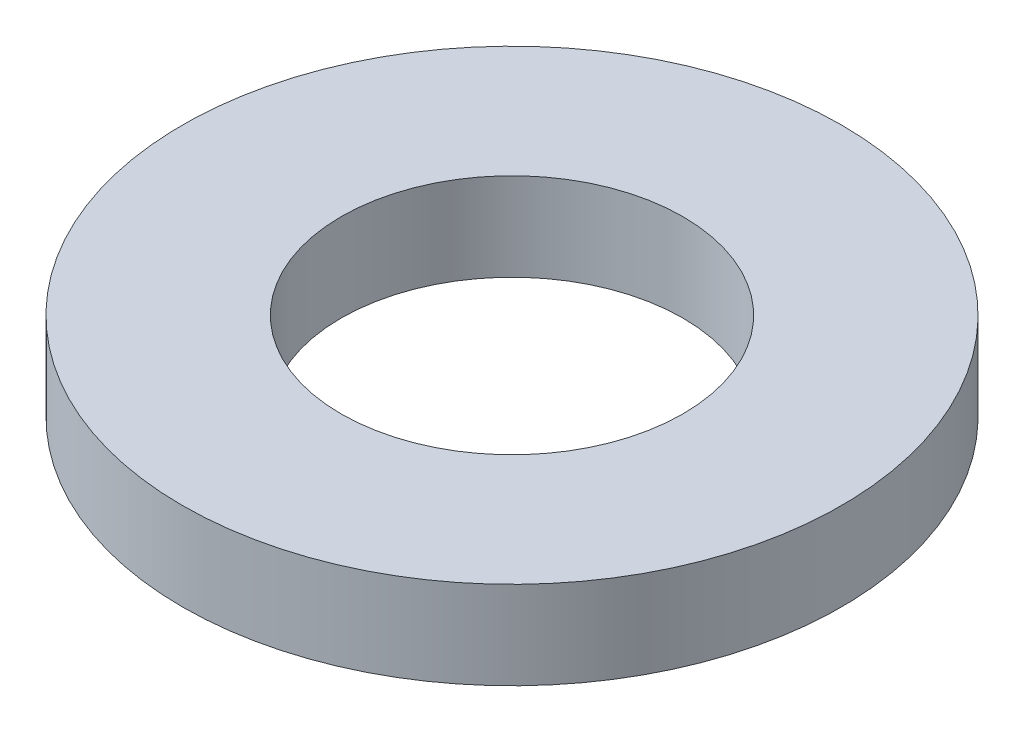
ISO-10303-21;
HEADER;
FILE_DESCRIPTION(('STEP AP214'),'2;1');
FILE_NAME('part.step','',(''),(''),'','','');
FILE_SCHEMA(('AUTOMOTIVE_DESIGN { 1 0 10303 214 1 1 1 1 }'));
ENDSEC;
DATA;
#1=APPLICATION_CONTEXT('core data for automotive mechanical design processes');
#2=APPLICATION_PROTOCOL_DEFINITION('international standard','automotive_design',2000,#1);
#3=PRODUCT_CONTEXT('',#1,'mechanical');
#4=PRODUCT('Part','Part','',(#3));
#5=PRODUCT_RELATED_PRODUCT_CATEGORY('part','',(#4));
#6=PRODUCT_DEFINITION_FORMATION('','',#4);
#7=PRODUCT_DEFINITION_CONTEXT('part definition',#1,'design');
#8=PRODUCT_DEFINITION('design','',#6,#7);
#9=PRODUCT_DEFINITION_SHAPE('','',#8);
#10=(LENGTH_UNIT() NAMED_UNIT(*) SI_UNIT(.MILLI.,.METRE.));
#11=(NAMED_UNIT(*) PLANE_ANGLE_UNIT() SI_UNIT($,.RADIAN.));
#12=(NAMED_UNIT(*) SI_UNIT($,.STERADIAN.) SOLID_ANGLE_UNIT());
#13=UNCERTAINTY_MEASURE_WITH_UNIT(LENGTH_MEASURE(1.E-05),#10,'distance_accuracy_value','');
#14=(GEOMETRIC_REPRESENTATION_CONTEXT(3) GLOBAL_UNCERTAINTY_ASSIGNED_CONTEXT((#13)) GLOBAL_UNIT_ASSIGNED_CONTEXT((#10,
#11,#12)) REPRESENTATION_CONTEXT('',''));
#15=CARTESIAN_POINT('',(0.,0.,0.));
#16=DIRECTION('',(0.,0.,1.));
#17=DIRECTION('',(1.,0.,0.));
#18=AXIS2_PLACEMENT_3D('',#15,#16,#17);
#19=CARTESIAN_POINT('',(0.,18.,0.));
#20=DIRECTION('',(0.,-1.,0.));
#21=DIRECTION('',(0.,0.,-1.));
#22=AXIS2_PLACEMENT_3D('',#19,#20,#21);
#23=CYLINDRICAL_SURFACE('',#22,67.5);
#24=CARTESIAN_POINT('',(0.,18.,0.));
#25=DIRECTION('',(0.,1.,0.));
#26=DIRECTION('',(0.,0.,1.));
#27=AXIS2_PLACEMENT_3D('',#24,#25,#26);
#28=CIRCLE('',#27,67.5);
#29=CARTESIAN_POINT('',(0.,18.,67.5));
#30=VERTEX_POINT('',#29);
#31=EDGE_CURVE('E10',#30,#30,#28,.T.);
#32=ORIENTED_EDGE('',*,*,#31,.F.);
#33=EDGE_LOOP('',(#32));
#34=FACE_BOUND('',#33,.T.);
#35=CARTESIAN_POINT('',(0.,0.,0.));
#36=DIRECTION('',(0.,1.,0.));
#37=DIRECTION('',(0.,0.,1.));
#38=AXIS2_PLACEMENT_3D('',#35,#36,#37);
#39=CIRCLE('',#38,67.5);
#40=CARTESIAN_POINT('',(0.,0.,67.5));
#41=VERTEX_POINT('',#40);
#42=EDGE_CURVE('E37',#41,#41,#39,.T.);
#43=ORIENTED_EDGE('',*,*,#42,.T.);
#44=EDGE_LOOP('',(#43));
#45=FACE_BOUND('',#44,.T.);
#46=ADVANCED_FACE('F40',(#34,#45),#23,.T.);
#47=CARTESIAN_POINT('',(0.,18.,0.));
#48=DIRECTION('',(0.,1.,0.));
#49=DIRECTION('',(0.,0.,1.));
#50=AXIS2_PLACEMENT_3D('',#47,#48,#49);
#51=PLANE('',#50);
#52=CARTESIAN_POINT('',(0.,18.,0.));
#53=DIRECTION('',(0.,1.,0.));
#54=DIRECTION('',(0.,0.,1.));
#55=AXIS2_PLACEMENT_3D('',#52,#53,#54);
#56=CIRCLE('',#55,35.);
#57=CARTESIAN_POINT('',(0.,18.,35.));
#58=VERTEX_POINT('',#57);
#59=EDGE_CURVE('E50',#58,#58,#56,.T.);
#60=ORIENTED_EDGE('',*,*,#59,.F.);
#61=EDGE_LOOP('',(#60));
#62=FACE_BOUND('',#61,.T.);
#63=ORIENTED_EDGE('',*,*,#31,.T.);
#64=EDGE_LOOP('',(#63));
#65=FACE_BOUND('',#64,.T.);
#66=ADVANCED_FACE('F59',(#62,#65),#51,.T.);
#67=CARTESIAN_POINT('',(0.,0.,0.));
#68=DIRECTION('',(0.,1.,0.));
#69=DIRECTION('',(0.,0.,1.));
#70=AXIS2_PLACEMENT_3D('',#67,#68,#69);
#71=PLANE('',#70);
#72=CARTESIAN_POINT('',(0.,0.,0.));
#73=DIRECTION('',(0.,1.,0.));
#74=DIRECTION('',(0.,0.,1.));
#75=AXIS2_PLACEMENT_3D('',#72,#73,#74);
#76=CIRCLE('',#75,35.);
#77=CARTESIAN_POINT('',(0.,0.,35.));
#78=VERTEX_POINT('',#77);
#79=EDGE_CURVE('E47',#78,#78,#76,.T.);
#80=ORIENTED_EDGE('',*,*,#79,.T.);
#81=EDGE_LOOP('',(#80));
#82=FACE_BOUND('',#81,.T.);
#83=ORIENTED_EDGE('',*,*,#42,.F.);
#84=EDGE_LOOP('',(#83));
#85=FACE_BOUND('',#84,.T.);
#86=ADVANCED_FACE('F58',(#82,#85),#71,.F.);
#87=CARTESIAN_POINT('',(0.,18.,0.));
#88=DIRECTION('',(0.,-1.,0.));
#89=DIRECTION('',(0.,0.,-1.));
#90=AXIS2_PLACEMENT_3D('',#87,#88,#89);
#91=CYLINDRICAL_SURFACE('',#90,35.);
#92=ORIENTED_EDGE('',*,*,#59,.T.);
#93=EDGE_LOOP('',(#92));
#94=FACE_BOUND('',#93,.T.);
#95=ORIENTED_EDGE('',*,*,#79,.F.);
#96=EDGE_LOOP('',(#95));
#97=FACE_BOUND('',#96,.T.);
#98=ADVANCED_FACE('F54',(#94,#97),#91,.F.);
#99=CLOSED_SHELL('',(#46,#66,#86,#98));
#100=MANIFOLD_SOLID_BREP('B2',#99);
#101=ADVANCED_BREP_SHAPE_REPRESENTATION('',(#18,#100),#14);
#102=SHAPE_DEFINITION_REPRESENTATION(#9,#101);
ENDSEC;
END-ISO-10303-21;
